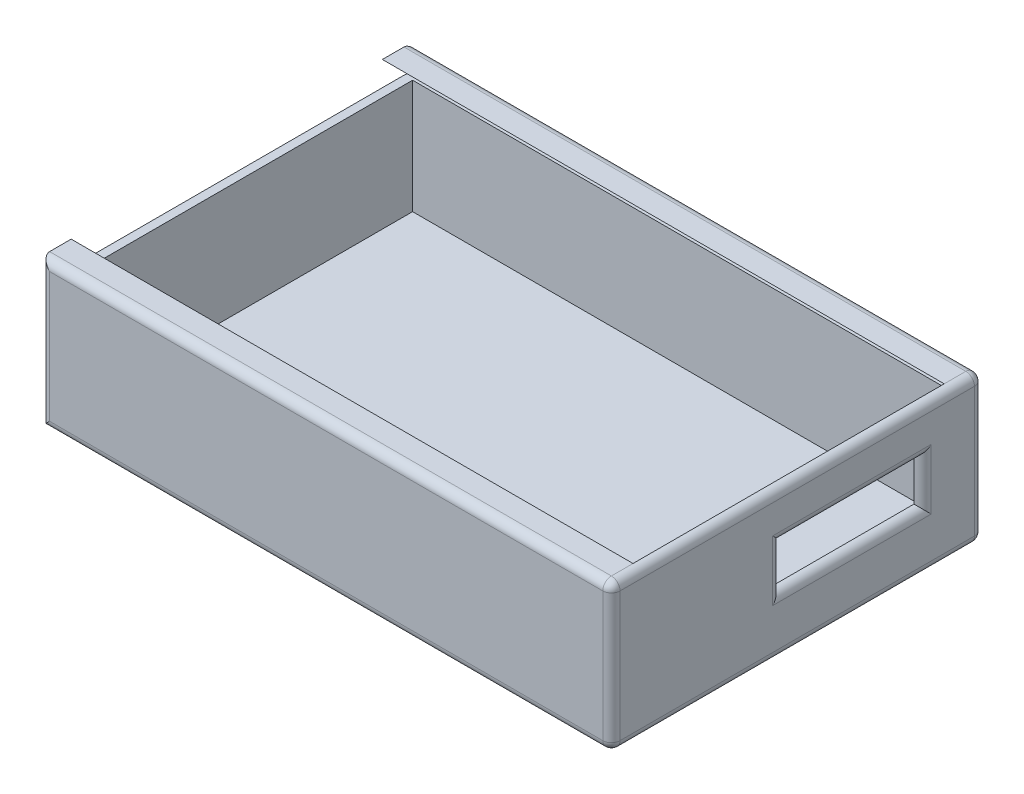
ISO-10303-21;
HEADER;
FILE_DESCRIPTION(('STEP AP214'),'2;1');
FILE_NAME('part.step','',(''),(''),'','','');
FILE_SCHEMA(('AUTOMOTIVE_DESIGN { 1 0 10303 214 1 1 1 1 }'));
ENDSEC;
DATA;
#1=APPLICATION_CONTEXT('core data for automotive mechanical design processes');
#2=APPLICATION_PROTOCOL_DEFINITION('international standard','automotive_design',2000,#1);
#3=PRODUCT_CONTEXT('',#1,'mechanical');
#4=PRODUCT('Part','Part','',(#3));
#5=PRODUCT_RELATED_PRODUCT_CATEGORY('part','',(#4));
#6=PRODUCT_DEFINITION_FORMATION('','',#4);
#7=PRODUCT_DEFINITION_CONTEXT('part definition',#1,'design');
#8=PRODUCT_DEFINITION('design','',#6,#7);
#9=PRODUCT_DEFINITION_SHAPE('','',#8);
#10=(LENGTH_UNIT() NAMED_UNIT(*) SI_UNIT(.MILLI.,.METRE.));
#11=(NAMED_UNIT(*) PLANE_ANGLE_UNIT() SI_UNIT($,.RADIAN.));
#12=(NAMED_UNIT(*) SI_UNIT($,.STERADIAN.) SOLID_ANGLE_UNIT());
#13=UNCERTAINTY_MEASURE_WITH_UNIT(LENGTH_MEASURE(1.E-05),#10,'distance_accuracy_value','');
#14=(GEOMETRIC_REPRESENTATION_CONTEXT(3) GLOBAL_UNCERTAINTY_ASSIGNED_CONTEXT((#13)) GLOBAL_UNIT_ASSIGNED_CONTEXT((#10,
#11,#12)) REPRESENTATION_CONTEXT('',''));
#15=CARTESIAN_POINT('',(0.,0.,0.));
#16=DIRECTION('',(0.,0.,1.));
#17=DIRECTION('',(1.,0.,0.));
#18=AXIS2_PLACEMENT_3D('',#15,#16,#17);
#19=CARTESIAN_POINT('',(-65.4502937062937,43.18,-49.3799090909091));
#20=DIRECTION('',(1.,0.,0.));
#21=DIRECTION('',(0.,0.,-1.));
#22=AXIS2_PLACEMENT_3D('',#19,#20,#21);
#23=PLANE('',#22);
#24=DIRECTION('',(0.,0.,1.));
#25=VECTOR('',#24,1.);
#26=CARTESIAN_POINT('',(-65.4502937062937,43.18,-49.3799090909091));
#27=LINE('',#26,#25);
#28=CARTESIAN_POINT('',(-65.4502937062937,43.18,-46.8399090909091));
#29=VERTEX_POINT('',#28);
#30=CARTESIAN_POINT('',(-65.4502937062937,43.18,-40.4899090909091));
#31=VERTEX_POINT('',#30);
#32=EDGE_CURVE('E399',#29,#31,#27,.T.);
#33=ORIENTED_EDGE('',*,*,#32,.F.);
#34=DIRECTION('',(0.,-1.,0.));
#35=VECTOR('',#34,1.);
#36=CARTESIAN_POINT('',(-65.4502937062937,43.18,-46.8399090909091));
#37=LINE('',#36,#35);
#38=CARTESIAN_POINT('',(-65.4502937062937,36.8300000000001,-46.8399090909091));
#39=VERTEX_POINT('',#38);
#40=EDGE_CURVE('E357',#29,#39,#37,.T.);
#41=ORIENTED_EDGE('',*,*,#40,.T.);
#42=DIRECTION('',(0.,-0.707106781186544,-0.707106781186551));
#43=VECTOR('',#42,1.);
#44=CARTESIAN_POINT('',(-65.4502937062937,43.18,-40.4899090909091));
#45=LINE('',#44,#43);
#46=EDGE_CURVE('E250',#31,#39,#45,.T.);
#47=ORIENTED_EDGE('',*,*,#46,.F.);
#48=EDGE_LOOP('',(#33,#41,#47));
#49=FACE_BOUND('',#48,.T.);
#50=ADVANCED_FACE('F49',(#49),#23,.F.);
#51=DIRECTION('',(0.,0.,1.));
#52=VECTOR('',#51,1.);
#53=CARTESIAN_POINT('',(-65.4502937062937,35.9957951031447,-47.6741139877644));
#54=LINE('',#53,#52);
#55=CARTESIAN_POINT('',(-65.4502937062937,35.9957951031447,-46.8399090909091));
#56=VERTEX_POINT('',#55);
#57=CARTESIAN_POINT('',(-65.4502937062937,35.9957951031447,57.3000909090909));
#58=VERTEX_POINT('',#57);
#59=EDGE_CURVE('E474',#56,#58,#54,.T.);
#60=ORIENTED_EDGE('',*,*,#59,.F.);
#61=DIRECTION('',(0.,-1.,0.));
#62=VECTOR('',#61,1.);
#63=CARTESIAN_POINT('',(-65.4502937062937,43.18,-46.8399090909091));
#64=LINE('',#63,#62);
#65=CARTESIAN_POINT('',(-65.4502937062937,0.,-46.8399090909091));
#66=VERTEX_POINT('',#65);
#67=EDGE_CURVE('E360',#56,#66,#64,.T.);
#68=ORIENTED_EDGE('',*,*,#67,.T.);
#69=DIRECTION('',(0.,0.,1.));
#70=VECTOR('',#69,1.);
#71=CARTESIAN_POINT('',(-65.4502937062937,0.,-49.3799090909091));
#72=LINE('',#71,#70);
#73=CARTESIAN_POINT('',(-65.4502937062937,0.,57.3000909090909));
#74=VERTEX_POINT('',#73);
#75=EDGE_CURVE('E400',#66,#74,#72,.T.);
#76=ORIENTED_EDGE('',*,*,#75,.T.);
#77=DIRECTION('',(0.,-1.,0.));
#78=VECTOR('',#77,1.);
#79=CARTESIAN_POINT('',(-65.4502937062937,43.18,57.3000909090909));
#80=LINE('',#79,#78);
#81=EDGE_CURVE('E363',#74,#58,#80,.F.);
#82=ORIENTED_EDGE('',*,*,#81,.T.);
#83=EDGE_LOOP('',(#60,#68,#76,#82));
#84=FACE_BOUND('',#83,.T.);
#85=ADVANCED_FACE('F580',(#84),#23,.F.);
#86=CARTESIAN_POINT('',(0.,43.18,0.));
#87=DIRECTION('',(0.,1.,0.));
#88=DIRECTION('',(0.,0.,1.));
#89=AXIS2_PLACEMENT_3D('',#86,#87,#88);
#90=PLANE('',#89);
#91=DIRECTION('',(0.,0.,-1.));
#92=VECTOR('',#91,1.);
#93=CARTESIAN_POINT('',(99.6497062937063,43.18,-49.3799090909091));
#94=LINE('',#93,#92);
#95=CARTESIAN_POINT('',(99.6497062937063,43.18,-40.4899090909091));
#96=VERTEX_POINT('',#95);
#97=CARTESIAN_POINT('',(99.6497062937063,43.18,-46.8399090909091));
#98=VERTEX_POINT('',#97);
#99=EDGE_CURVE('E386',#96,#98,#94,.T.);
#100=ORIENTED_EDGE('',*,*,#99,.T.);
#101=DIRECTION('',(-1.,0.,0.));
#102=VECTOR('',#101,1.);
#103=CARTESIAN_POINT('',(-65.4502937062937,43.18,-46.8399090909091));
#104=LINE('',#103,#102);
#105=EDGE_CURVE('E382',#98,#29,#104,.T.);
#106=ORIENTED_EDGE('',*,*,#105,.T.);
#107=ORIENTED_EDGE('',*,*,#32,.T.);
#108=DIRECTION('',(-1.,0.,0.));
#109=VECTOR('',#108,1.);
#110=CARTESIAN_POINT('',(205.701733068652,43.18,-40.4899090909091));
#111=LINE('',#110,#109);
#112=EDGE_CURVE('E466',#96,#31,#111,.T.);
#113=ORIENTED_EDGE('',*,*,#112,.F.);
#114=EDGE_LOOP('',(#100,#106,#107,#113));
#115=FACE_BOUND('',#114,.T.);
#116=ADVANCED_FACE('F502',(#115),#90,.T.);
#117=CARTESIAN_POINT('',(99.6497062937063,43.18,-49.3799090909091));
#118=DIRECTION('',(-1.,0.,0.));
#119=DIRECTION('',(0.,0.,1.));
#120=AXIS2_PLACEMENT_3D('',#117,#118,#119);
#121=PLANE('',#120);
#122=DIRECTION('',(0.,0.,-1.));
#123=VECTOR('',#122,1.);
#124=CARTESIAN_POINT('',(99.6497062937063,29.6823840244611,-31.5999090909091));
#125=LINE('',#124,#123);
#126=CARTESIAN_POINT('',(99.6497062937063,29.6823840244611,9.93829321179274));
#127=VERTEX_POINT('',#126);
#128=CARTESIAN_POINT('',(99.6497062937063,29.6823840244611,-31.5999090909091));
#129=VERTEX_POINT('',#128);
#130=EDGE_CURVE('E218',#127,#129,#125,.T.);
#131=ORIENTED_EDGE('',*,*,#130,.F.);
#132=DIRECTION('',(0.,1.,0.));
#133=VECTOR('',#132,1.);
#134=CARTESIAN_POINT('',(99.6497062937063,32.2223840244611,9.93829321179274));
#135=LINE('',#134,#133);
#136=CARTESIAN_POINT('',(99.6497062937063,17.018,9.93829321179274));
#137=VERTEX_POINT('',#136);
#138=EDGE_CURVE('E211',#137,#127,#135,.T.);
#139=ORIENTED_EDGE('',*,*,#138,.F.);
#140=DIRECTION('',(0.,0.,1.));
#141=VECTOR('',#140,1.);
#142=CARTESIAN_POINT('',(99.6497062937063,17.018,-31.5999090909091));
#143=LINE('',#142,#141);
#144=CARTESIAN_POINT('',(99.6497062937063,17.018,-31.5999090909091));
#145=VERTEX_POINT('',#144);
#146=EDGE_CURVE('E216',#145,#137,#143,.T.);
#147=ORIENTED_EDGE('',*,*,#146,.F.);
#148=DIRECTION('',(0.,-1.,0.));
#149=VECTOR('',#148,1.);
#150=CARTESIAN_POINT('',(99.6497062937063,29.6823840244611,-31.5999090909091));
#151=LINE('',#150,#149);
#152=EDGE_CURVE('E231',#129,#145,#151,.T.);
#153=ORIENTED_EDGE('',*,*,#152,.F.);
#154=EDGE_LOOP('',(#131,#139,#147,#153));
#155=FACE_BOUND('',#154,.T.);
#156=DIRECTION('',(0.,0.,-1.));
#157=VECTOR('',#156,1.);
#158=CARTESIAN_POINT('',(99.6497062937063,43.18,-49.3799090909091));
#159=LINE('',#158,#157);
#160=CARTESIAN_POINT('',(99.6497062937063,43.18,50.9500909090909));
#161=VERTEX_POINT('',#160);
#162=EDGE_CURVE('E408',#161,#96,#159,.T.);
#163=ORIENTED_EDGE('',*,*,#162,.T.);
#164=DIRECTION('',(0.,0.707106781186544,0.707106781186551));
#165=VECTOR('',#164,1.);
#166=CARTESIAN_POINT('',(99.6497062937063,43.18,-40.4899090909091));
#167=LINE('',#166,#165);
#168=CARTESIAN_POINT('',(99.6497062937063,35.9957951031447,-47.6741139877644));
#169=VERTEX_POINT('',#168);
#170=EDGE_CURVE('E481',#169,#96,#167,.T.);
#171=ORIENTED_EDGE('',*,*,#170,.F.);
#172=DIRECTION('',(0.,0.,-1.));
#173=VECTOR('',#172,1.);
#174=CARTESIAN_POINT('',(99.6497062937063,35.9957951031447,-47.6741139877644));
#175=LINE('',#174,#173);
#176=CARTESIAN_POINT('',(99.6497062937063,35.9957951031447,-46.8399090909091));
#177=VERTEX_POINT('',#176);
#178=EDGE_CURVE('E452',#177,#169,#175,.T.);
#179=ORIENTED_EDGE('',*,*,#178,.F.);
#180=DIRECTION('',(0.,-1.,0.));
#181=VECTOR('',#180,1.);
#182=CARTESIAN_POINT('',(99.6497062937063,43.18,-46.8399090909091));
#183=LINE('',#182,#181);
#184=CARTESIAN_POINT('',(99.6497062937063,2.54,-46.8399090909091));
#185=VERTEX_POINT('',#184);
#186=EDGE_CURVE('E418',#177,#185,#183,.T.);
#187=ORIENTED_EDGE('',*,*,#186,.T.);
#188=DIRECTION('',(0.,0.,-1.));
#189=VECTOR('',#188,1.);
#190=CARTESIAN_POINT('',(99.6497062937063,2.54,-49.3799090909091));
#191=LINE('',#190,#189);
#192=CARTESIAN_POINT('',(99.6497062937063,2.54,57.3000909090909));
#193=VERTEX_POINT('',#192);
#194=EDGE_CURVE('E417',#193,#185,#191,.T.);
#195=ORIENTED_EDGE('',*,*,#194,.F.);
#196=DIRECTION('',(0.,-1.,0.));
#197=VECTOR('',#196,1.);
#198=CARTESIAN_POINT('',(99.6497062937063,43.18,57.3000909090909));
#199=LINE('',#198,#197);
#200=CARTESIAN_POINT('',(99.6497062937063,35.9957951031447,57.3000909090909));
#201=VERTEX_POINT('',#200);
#202=EDGE_CURVE('E421',#201,#193,#199,.T.);
#203=ORIENTED_EDGE('',*,*,#202,.F.);
#204=CARTESIAN_POINT('',(99.6497062937063,35.9957951031447,58.1342958059463));
#205=VERTEX_POINT('',#204);
#206=EDGE_CURVE('E449',#205,#201,#175,.T.);
#207=ORIENTED_EDGE('',*,*,#206,.F.);
#208=DIRECTION('',(0.,0.707106781186544,-0.707106781186551));
#209=VECTOR('',#208,1.);
#210=CARTESIAN_POINT('',(99.6497062937063,43.18,50.9500909090909));
#211=LINE('',#210,#209);
#212=EDGE_CURVE('E470',#205,#161,#211,.T.);
#213=ORIENTED_EDGE('',*,*,#212,.T.);
#214=EDGE_LOOP('',(#163,#171,#179,#187,#195,#203,#207,#213));
#215=FACE_BOUND('',#214,.T.);
#216=ADVANCED_FACE('F213',(#155,#215),#121,.T.);
#217=DIRECTION('',(0.,-0.707106781186544,0.707106781186551));
#218=VECTOR('',#217,1.);
#219=CARTESIAN_POINT('',(-65.4502937062937,43.18,50.9500909090909));
#220=LINE('',#219,#218);
#221=CARTESIAN_POINT('',(-65.4502937062937,43.18,50.9500909090909));
#222=VERTEX_POINT('',#221);
#223=CARTESIAN_POINT('',(-65.4502937062937,36.8300000000001,57.3000909090909));
#224=VERTEX_POINT('',#223);
#225=EDGE_CURVE('E458',#222,#224,#220,.T.);
#226=ORIENTED_EDGE('',*,*,#225,.T.);
#227=DIRECTION('',(0.,-1.,0.));
#228=VECTOR('',#227,1.);
#229=CARTESIAN_POINT('',(-65.4502937062937,43.18,57.3000909090909));
#230=LINE('',#229,#228);
#231=CARTESIAN_POINT('',(-65.4502937062937,43.18,57.3000909090909));
#232=VERTEX_POINT('',#231);
#233=EDGE_CURVE('E366',#224,#232,#230,.F.);
#234=ORIENTED_EDGE('',*,*,#233,.T.);
#235=EDGE_CURVE('E404',#222,#232,#27,.T.);
#236=ORIENTED_EDGE('',*,*,#235,.F.);
#237=EDGE_LOOP('',(#226,#234,#236));
#238=FACE_BOUND('',#237,.T.);
#239=ADVANCED_FACE('F543',(#238),#23,.F.);
#240=CARTESIAN_POINT('',(-65.4502937062937,43.18,59.8400909090909));
#241=DIRECTION('',(0.,0.,-1.));
#242=DIRECTION('',(-1.,0.,0.));
#243=AXIS2_PLACEMENT_3D('',#240,#241,#242);
#244=PLANE('',#243);
#245=DIRECTION('',(1.,0.,0.));
#246=VECTOR('',#245,1.);
#247=CARTESIAN_POINT('',(-65.4502937062937,40.64,59.8400909090909));
#248=LINE('',#247,#246);
#249=CARTESIAN_POINT('',(99.6497062937063,40.64,59.8400909090909));
#250=VERTEX_POINT('',#249);
#251=CARTESIAN_POINT('',(-62.9102937062937,40.64,59.8400909090909));
#252=VERTEX_POINT('',#251);
#253=EDGE_CURVE('E310',#250,#252,#248,.F.);
#254=ORIENTED_EDGE('',*,*,#253,.T.);
#255=DIRECTION('',(0.,-1.,0.));
#256=VECTOR('',#255,1.);
#257=CARTESIAN_POINT('',(-62.9102937062937,43.18,59.8400909090909));
#258=LINE('',#257,#256);
#259=CARTESIAN_POINT('',(-62.9102937062937,2.54,59.8400909090909));
#260=VERTEX_POINT('',#259);
#261=EDGE_CURVE('E239',#252,#260,#258,.T.);
#262=ORIENTED_EDGE('',*,*,#261,.T.);
#263=DIRECTION('',(1.,0.,0.));
#264=VECTOR('',#263,1.);
#265=CARTESIAN_POINT('',(-65.4502937062937,2.54,59.8400909090909));
#266=LINE('',#265,#264);
#267=CARTESIAN_POINT('',(99.6497062937063,2.54,59.8400909090909));
#268=VERTEX_POINT('',#267);
#269=EDGE_CURVE('E316',#260,#268,#266,.T.);
#270=ORIENTED_EDGE('',*,*,#269,.T.);
#271=DIRECTION('',(0.,-1.,0.));
#272=VECTOR('',#271,1.);
#273=CARTESIAN_POINT('',(99.6497062937063,43.18,59.8400909090909));
#274=LINE('',#273,#272);
#275=EDGE_CURVE('E313',#268,#250,#274,.F.);
#276=ORIENTED_EDGE('',*,*,#275,.T.);
#277=EDGE_LOOP('',(#254,#262,#270,#276));
#278=FACE_BOUND('',#277,.T.);
#279=ADVANCED_FACE('F610',(#278),#244,.F.);
#280=CARTESIAN_POINT('',(102.189706293706,43.18,-49.3799090909091));
#281=DIRECTION('',(-1.,0.,0.));
#282=DIRECTION('',(0.,0.,1.));
#283=AXIS2_PLACEMENT_3D('',#280,#281,#282);
#284=PLANE('',#283);
#285=DIRECTION('',(0.,1.,0.));
#286=VECTOR('',#285,1.);
#287=CARTESIAN_POINT('',(102.189706293706,32.2223840244611,12.4782932117927));
#288=LINE('',#287,#286);
#289=CARTESIAN_POINT('',(102.189706293706,14.478,12.4782932117927));
#290=VERTEX_POINT('',#289);
#291=CARTESIAN_POINT('',(102.189706293706,32.2223840244611,12.4782932117927));
#292=VERTEX_POINT('',#291);
#293=EDGE_CURVE('E233',#290,#292,#288,.T.);
#294=ORIENTED_EDGE('',*,*,#293,.T.);
#295=DIRECTION('',(0.,0.,-1.));
#296=VECTOR('',#295,1.);
#297=CARTESIAN_POINT('',(102.189706293706,32.2223840244611,-49.3799090909091));
#298=LINE('',#297,#296);
#299=CARTESIAN_POINT('',(102.189706293706,32.2223840244611,-34.1399090909091));
#300=VERTEX_POINT('',#299);
#301=EDGE_CURVE('E65',#292,#300,#298,.T.);
#302=ORIENTED_EDGE('',*,*,#301,.T.);
#303=DIRECTION('',(0.,-1.,0.));
#304=VECTOR('',#303,1.);
#305=CARTESIAN_POINT('',(102.189706293706,43.18,-34.1399090909091));
#306=LINE('',#305,#304);
#307=CARTESIAN_POINT('',(102.189706293706,14.478,-34.1399090909091));
#308=VERTEX_POINT('',#307);
#309=EDGE_CURVE('E321',#300,#308,#306,.T.);
#310=ORIENTED_EDGE('',*,*,#309,.T.);
#311=DIRECTION('',(0.,0.,1.));
#312=VECTOR('',#311,1.);
#313=CARTESIAN_POINT('',(102.189706293706,14.478,-49.3799090909091));
#314=LINE('',#313,#312);
#315=EDGE_CURVE('E73',#308,#290,#314,.T.);
#316=ORIENTED_EDGE('',*,*,#315,.T.);
#317=EDGE_LOOP('',(#294,#302,#310,#316));
#318=FACE_BOUND('',#317,.T.);
#319=DIRECTION('',(0.,-1.,0.));
#320=VECTOR('',#319,1.);
#321=CARTESIAN_POINT('',(102.189706293706,43.18,-46.8399090909091));
#322=LINE('',#321,#320);
#323=CARTESIAN_POINT('',(102.189706293706,2.54,-46.8399090909091));
#324=VERTEX_POINT('',#323);
#325=CARTESIAN_POINT('',(102.189706293706,40.64,-46.8399090909091));
#326=VERTEX_POINT('',#325);
#327=EDGE_CURVE('E330',#324,#326,#322,.F.);
#328=ORIENTED_EDGE('',*,*,#327,.T.);
#329=DIRECTION('',(0.,0.,-1.));
#330=VECTOR('',#329,1.);
#331=CARTESIAN_POINT('',(102.189706293706,40.64,59.8400909090909));
#332=LINE('',#331,#330);
#333=CARTESIAN_POINT('',(102.189706293706,40.64,57.3000909090909));
#334=VERTEX_POINT('',#333);
#335=EDGE_CURVE('E326',#326,#334,#332,.F.);
#336=ORIENTED_EDGE('',*,*,#335,.T.);
#337=DIRECTION('',(0.,-1.,0.));
#338=VECTOR('',#337,1.);
#339=CARTESIAN_POINT('',(102.189706293706,43.18,57.3000909090909));
#340=LINE('',#339,#338);
#341=CARTESIAN_POINT('',(102.189706293706,2.54,57.3000909090909));
#342=VERTEX_POINT('',#341);
#343=EDGE_CURVE('E336',#334,#342,#340,.T.);
#344=ORIENTED_EDGE('',*,*,#343,.T.);
#345=DIRECTION('',(0.,0.,-1.));
#346=VECTOR('',#345,1.);
#347=CARTESIAN_POINT('',(102.189706293706,2.54,-49.3799090909091));
#348=LINE('',#347,#346);
#349=EDGE_CURVE('E333',#342,#324,#348,.T.);
#350=ORIENTED_EDGE('',*,*,#349,.T.);
#351=EDGE_LOOP('',(#328,#336,#344,#350));
#352=FACE_BOUND('',#351,.T.);
#353=ADVANCED_FACE('F612',(#318,#352),#284,.F.);
#354=CARTESIAN_POINT('',(-65.4502937062937,43.18,-49.3799090909091));
#355=DIRECTION('',(0.,0.,1.));
#356=DIRECTION('',(1.,0.,0.));
#357=AXIS2_PLACEMENT_3D('',#354,#355,#356);
#358=PLANE('',#357);
#359=DIRECTION('',(0.,-1.,0.));
#360=VECTOR('',#359,1.);
#361=CARTESIAN_POINT('',(-62.9102937062937,43.18,-49.3799090909091));
#362=LINE('',#361,#360);
#363=CARTESIAN_POINT('',(-62.9102937062937,2.54,-49.3799090909091));
#364=VERTEX_POINT('',#363);
#365=CARTESIAN_POINT('',(-62.9102937062937,40.64,-49.3799090909091));
#366=VERTEX_POINT('',#365);
#367=EDGE_CURVE('E373',#364,#366,#362,.F.);
#368=ORIENTED_EDGE('',*,*,#367,.T.);
#369=DIRECTION('',(-1.,0.,0.));
#370=VECTOR('',#369,1.);
#371=CARTESIAN_POINT('',(102.189706293706,40.64,-49.3799090909091));
#372=LINE('',#371,#370);
#373=CARTESIAN_POINT('',(99.6497062937063,40.64,-49.3799090909091));
#374=VERTEX_POINT('',#373);
#375=EDGE_CURVE('E369',#366,#374,#372,.F.);
#376=ORIENTED_EDGE('',*,*,#375,.T.);
#377=DIRECTION('',(0.,-1.,0.));
#378=VECTOR('',#377,1.);
#379=CARTESIAN_POINT('',(99.6497062937063,43.18,-49.3799090909091));
#380=LINE('',#379,#378);
#381=CARTESIAN_POINT('',(99.6497062937063,2.54,-49.3799090909091));
#382=VERTEX_POINT('',#381);
#383=EDGE_CURVE('E379',#374,#382,#380,.T.);
#384=ORIENTED_EDGE('',*,*,#383,.T.);
#385=DIRECTION('',(-1.,0.,0.));
#386=VECTOR('',#385,1.);
#387=CARTESIAN_POINT('',(-65.4502937062937,2.54,-49.3799090909091));
#388=LINE('',#387,#386);
#389=EDGE_CURVE('E376',#382,#364,#388,.T.);
#390=ORIENTED_EDGE('',*,*,#389,.T.);
#391=EDGE_LOOP('',(#368,#376,#384,#390));
#392=FACE_BOUND('',#391,.T.);
#393=ADVANCED_FACE('F619',(#392),#358,.F.);
#394=DIRECTION('',(1.,0.,0.));
#395=VECTOR('',#394,1.);
#396=CARTESIAN_POINT('',(102.189706293706,43.18,57.3000909090909));
#397=LINE('',#396,#395);
#398=CARTESIAN_POINT('',(99.6497062937063,43.18,57.3000909090909));
#399=VERTEX_POINT('',#398);
#400=EDGE_CURVE('E392',#232,#399,#397,.T.);
#401=ORIENTED_EDGE('',*,*,#400,.T.);
#402=DIRECTION('',(0.,0.,-1.));
#403=VECTOR('',#402,1.);
#404=CARTESIAN_POINT('',(99.6497062937063,43.18,-49.3799090909091));
#405=LINE('',#404,#403);
#406=EDGE_CURVE('E389',#399,#161,#405,.T.);
#407=ORIENTED_EDGE('',*,*,#406,.T.);
#408=DIRECTION('',(-1.,0.,0.));
#409=VECTOR('',#408,1.);
#410=CARTESIAN_POINT('',(205.701733068652,43.18,50.9500909090909));
#411=LINE('',#410,#409);
#412=EDGE_CURVE('E462',#161,#222,#411,.T.);
#413=ORIENTED_EDGE('',*,*,#412,.T.);
#414=ORIENTED_EDGE('',*,*,#235,.T.);
#415=EDGE_LOOP('',(#401,#407,#413,#414));
#416=FACE_BOUND('',#415,.T.);
#417=ADVANCED_FACE('F545',(#416),#90,.T.);
#418=CARTESIAN_POINT('',(0.,0.,0.));
#419=DIRECTION('',(0.,1.,0.));
#420=DIRECTION('',(0.,0.,1.));
#421=AXIS2_PLACEMENT_3D('',#418,#419,#420);
#422=PLANE('',#421);
#423=ORIENTED_EDGE('',*,*,#75,.F.);
#424=DIRECTION('',(-1.,0.,0.));
#425=VECTOR('',#424,1.);
#426=CARTESIAN_POINT('',(0.,0.,-46.8399090909091));
#427=LINE('',#426,#425);
#428=CARTESIAN_POINT('',(99.6497062937063,0.,-46.8399090909091));
#429=VERTEX_POINT('',#428);
#430=EDGE_CURVE('E339',#66,#429,#427,.F.);
#431=ORIENTED_EDGE('',*,*,#430,.T.);
#432=DIRECTION('',(0.,0.,-1.));
#433=VECTOR('',#432,1.);
#434=CARTESIAN_POINT('',(99.6497062937063,0.,0.));
#435=LINE('',#434,#433);
#436=CARTESIAN_POINT('',(99.6497062937063,0.,57.3000909090909));
#437=VERTEX_POINT('',#436);
#438=EDGE_CURVE('E342',#429,#437,#435,.F.);
#439=ORIENTED_EDGE('',*,*,#438,.T.);
#440=DIRECTION('',(1.,0.,0.));
#441=VECTOR('',#440,1.);
#442=CARTESIAN_POINT('',(0.,0.,57.3000909090909));
#443=LINE('',#442,#441);
#444=EDGE_CURVE('E345',#437,#74,#443,.F.);
#445=ORIENTED_EDGE('',*,*,#444,.T.);
#446=EDGE_LOOP('',(#423,#431,#439,#445));
#447=FACE_BOUND('',#446,.T.);
#448=ADVANCED_FACE('F584',(#447),#422,.F.);
#449=CARTESIAN_POINT('',(-62.9102937062937,43.18,-49.3799090909091));
#450=DIRECTION('',(1.,0.,0.));
#451=DIRECTION('',(0.,0.,-1.));
#452=AXIS2_PLACEMENT_3D('',#449,#450,#451);
#453=PLANE('',#452);
#454=DIRECTION('',(0.,0.,-1.));
#455=VECTOR('',#454,1.);
#456=CARTESIAN_POINT('',(-62.9102937062937,35.9957951031447,-49.3799090909091));
#457=LINE('',#456,#455);
#458=CARTESIAN_POINT('',(-62.9102937062937,35.9957951031447,57.3000909090909));
#459=VERTEX_POINT('',#458);
#460=CARTESIAN_POINT('',(-62.9102937062937,35.9957951031447,-46.8399090909091));
#461=VERTEX_POINT('',#460);
#462=EDGE_CURVE('E446',#459,#461,#457,.T.);
#463=ORIENTED_EDGE('',*,*,#462,.F.);
#464=DIRECTION('',(0.,-1.,0.));
#465=VECTOR('',#464,1.);
#466=CARTESIAN_POINT('',(-62.9102937062937,43.18,57.3000909090909));
#467=LINE('',#466,#465);
#468=CARTESIAN_POINT('',(-62.9102937062937,2.54,57.3000909090909));
#469=VERTEX_POINT('',#468);
#470=EDGE_CURVE('E405',#459,#469,#467,.T.);
#471=ORIENTED_EDGE('',*,*,#470,.T.);
#472=DIRECTION('',(0.,0.,1.));
#473=VECTOR('',#472,1.);
#474=CARTESIAN_POINT('',(-62.9102937062937,2.54,-49.3799090909091));
#475=LINE('',#474,#473);
#476=CARTESIAN_POINT('',(-62.9102937062937,2.54,-46.8399090909091));
#477=VERTEX_POINT('',#476);
#478=EDGE_CURVE('E431',#477,#469,#475,.T.);
#479=ORIENTED_EDGE('',*,*,#478,.F.);
#480=DIRECTION('',(0.,-1.,0.));
#481=VECTOR('',#480,1.);
#482=CARTESIAN_POINT('',(-62.9102937062937,43.18,-46.8399090909091));
#483=LINE('',#482,#481);
#484=EDGE_CURVE('E412',#461,#477,#483,.T.);
#485=ORIENTED_EDGE('',*,*,#484,.F.);
#486=EDGE_LOOP('',(#463,#471,#479,#485));
#487=FACE_BOUND('',#486,.T.);
#488=ADVANCED_FACE('F524',(#487),#453,.T.);
#489=CARTESIAN_POINT('',(-65.4502937062937,43.18,57.3000909090909));
#490=DIRECTION('',(0.,0.,-1.));
#491=DIRECTION('',(-1.,0.,0.));
#492=AXIS2_PLACEMENT_3D('',#489,#490,#491);
#493=PLANE('',#492);
#494=DIRECTION('',(-1.,0.,0.));
#495=VECTOR('',#494,1.);
#496=CARTESIAN_POINT('',(-65.4502937062937,35.9957951031447,57.3000909090909));
#497=LINE('',#496,#495);
#498=EDGE_CURVE('E443',#201,#459,#497,.T.);
#499=ORIENTED_EDGE('',*,*,#498,.F.);
#500=ORIENTED_EDGE('',*,*,#202,.T.);
#501=DIRECTION('',(1.,0.,0.));
#502=VECTOR('',#501,1.);
#503=CARTESIAN_POINT('',(-65.4502937062937,2.54,57.3000909090909));
#504=LINE('',#503,#502);
#505=EDGE_CURVE('E425',#469,#193,#504,.T.);
#506=ORIENTED_EDGE('',*,*,#505,.F.);
#507=ORIENTED_EDGE('',*,*,#470,.F.);
#508=EDGE_LOOP('',(#499,#500,#506,#507));
#509=FACE_BOUND('',#508,.T.);
#510=ADVANCED_FACE('F529',(#509),#493,.T.);
#511=CARTESIAN_POINT('',(-65.4502937062937,43.18,-46.8399090909091));
#512=DIRECTION('',(0.,0.,1.));
#513=DIRECTION('',(1.,0.,0.));
#514=AXIS2_PLACEMENT_3D('',#511,#512,#513);
#515=PLANE('',#514);
#516=DIRECTION('',(1.,0.,0.));
#517=VECTOR('',#516,1.);
#518=CARTESIAN_POINT('',(-65.4502937062937,35.9957951031447,-46.8399090909091));
#519=LINE('',#518,#517);
#520=EDGE_CURVE('E395',#461,#177,#519,.T.);
#521=ORIENTED_EDGE('',*,*,#520,.F.);
#522=ORIENTED_EDGE('',*,*,#484,.T.);
#523=DIRECTION('',(-1.,0.,0.));
#524=VECTOR('',#523,1.);
#525=CARTESIAN_POINT('',(-65.4502937062937,2.54,-46.8399090909091));
#526=LINE('',#525,#524);
#527=EDGE_CURVE('E413',#185,#477,#526,.T.);
#528=ORIENTED_EDGE('',*,*,#527,.F.);
#529=ORIENTED_EDGE('',*,*,#186,.F.);
#530=EDGE_LOOP('',(#521,#522,#528,#529));
#531=FACE_BOUND('',#530,.T.);
#532=ADVANCED_FACE('F519',(#531),#515,.T.);
#533=CARTESIAN_POINT('',(0.,2.54,0.));
#534=DIRECTION('',(0.,1.,0.));
#535=DIRECTION('',(0.,0.,1.));
#536=AXIS2_PLACEMENT_3D('',#533,#534,#535);
#537=PLANE('',#536);
#538=ORIENTED_EDGE('',*,*,#478,.T.);
#539=ORIENTED_EDGE('',*,*,#505,.T.);
#540=ORIENTED_EDGE('',*,*,#194,.T.);
#541=ORIENTED_EDGE('',*,*,#527,.T.);
#542=EDGE_LOOP('',(#538,#539,#540,#541));
#543=FACE_BOUND('',#542,.T.);
#544=ADVANCED_FACE('F522',(#543),#537,.T.);
#545=CARTESIAN_POINT('',(205.701733068652,43.18,-40.4899090909091));
#546=DIRECTION('',(0.,0.707106781186551,-0.707106781186544));
#547=DIRECTION('',(0.,0.707106781186544,0.707106781186551));
#548=AXIS2_PLACEMENT_3D('',#545,#546,#547);
#549=PLANE('',#548);
#550=ORIENTED_EDGE('',*,*,#46,.T.);
#551=CARTESIAN_POINT('',(-62.9102937062937,36.8300000000001,-46.8399090909091));
#552=DIRECTION('',(0.,0.707106781186551,-0.707106781186544));
#553=DIRECTION('',(0.,-0.707106781186544,-0.707106781186551));
#554=AXIS2_PLACEMENT_3D('',#551,#552,#553);
#555=ELLIPSE('',#554,3.59210244842764,2.54);
#556=CARTESIAN_POINT('',(-65.3093981621402,35.9957951031447,-47.6741139877644));
#557=VERTEX_POINT('',#556);
#558=EDGE_CURVE('E354',#39,#557,#555,.F.);
#559=ORIENTED_EDGE('',*,*,#558,.T.);
#560=DIRECTION('',(-1.,0.,0.));
#561=VECTOR('',#560,1.);
#562=CARTESIAN_POINT('',(205.701733068652,35.9957951031447,-47.6741139877644));
#563=LINE('',#562,#561);
#564=EDGE_CURVE('E453',#169,#557,#563,.T.);
#565=ORIENTED_EDGE('',*,*,#564,.F.);
#566=ORIENTED_EDGE('',*,*,#170,.T.);
#567=ORIENTED_EDGE('',*,*,#112,.T.);
#568=EDGE_LOOP('',(#550,#559,#565,#566,#567));
#569=FACE_BOUND('',#568,.T.);
#570=ADVANCED_FACE('F508',(#569),#549,.F.);
#571=CARTESIAN_POINT('',(205.701733068652,43.18,50.9500909090909));
#572=DIRECTION('',(0.,-0.707106781186551,-0.707106781186544));
#573=DIRECTION('',(0.,0.707106781186544,-0.707106781186551));
#574=AXIS2_PLACEMENT_3D('',#571,#572,#573);
#575=PLANE('',#574);
#576=DIRECTION('',(-1.,0.,0.));
#577=VECTOR('',#576,1.);
#578=CARTESIAN_POINT('',(205.701733068652,35.9957951031447,58.1342958059463));
#579=LINE('',#578,#577);
#580=CARTESIAN_POINT('',(-65.3093981621402,35.9957951031447,58.1342958059463));
#581=VERTEX_POINT('',#580);
#582=EDGE_CURVE('E457',#205,#581,#579,.T.);
#583=ORIENTED_EDGE('',*,*,#582,.T.);
#584=CARTESIAN_POINT('',(-62.9102937062937,36.8300000000001,57.3000909090909));
#585=DIRECTION('',(0.,-0.707106781186551,-0.707106781186544));
#586=DIRECTION('',(0.,-0.707106781186544,0.707106781186551));
#587=AXIS2_PLACEMENT_3D('',#584,#585,#586);
#588=ELLIPSE('',#587,3.59210244842764,2.54);
#589=EDGE_CURVE('E235',#581,#224,#588,.T.);
#590=ORIENTED_EDGE('',*,*,#589,.T.);
#591=ORIENTED_EDGE('',*,*,#225,.F.);
#592=ORIENTED_EDGE('',*,*,#412,.F.);
#593=ORIENTED_EDGE('',*,*,#212,.F.);
#594=EDGE_LOOP('',(#583,#590,#591,#592,#593));
#595=FACE_BOUND('',#594,.T.);
#596=ADVANCED_FACE('F532',(#595),#575,.T.);
#597=CARTESIAN_POINT('',(205.701733068652,35.9957951031447,-47.6741139877644));
#598=DIRECTION('',(0.,-1.,0.));
#599=DIRECTION('',(0.,0.,-1.));
#600=AXIS2_PLACEMENT_3D('',#597,#598,#599);
#601=PLANE('',#600);
#602=ORIENTED_EDGE('',*,*,#564,.T.);
#603=CARTESIAN_POINT('',(-62.9102937062937,35.9957951031447,-46.8399090909091));
#604=DIRECTION('',(0.,-1.,0.));
#605=DIRECTION('',(0.,0.,-1.));
#606=AXIS2_PLACEMENT_3D('',#603,#604,#605);
#607=CIRCLE('',#606,2.54);
#608=EDGE_CURVE('E348',#557,#56,#607,.F.);
#609=ORIENTED_EDGE('',*,*,#608,.T.);
#610=ORIENTED_EDGE('',*,*,#59,.T.);
#611=CARTESIAN_POINT('',(-62.9102937062937,35.9957951031447,57.3000909090909));
#612=DIRECTION('',(0.,-1.,0.));
#613=DIRECTION('',(0.,0.,-1.));
#614=AXIS2_PLACEMENT_3D('',#611,#612,#613);
#615=CIRCLE('',#614,2.54);
#616=EDGE_CURVE('E351',#58,#581,#615,.F.);
#617=ORIENTED_EDGE('',*,*,#616,.T.);
#618=ORIENTED_EDGE('',*,*,#582,.F.);
#619=ORIENTED_EDGE('',*,*,#206,.T.);
#620=ORIENTED_EDGE('',*,*,#498,.T.);
#621=ORIENTED_EDGE('',*,*,#462,.T.);
#622=ORIENTED_EDGE('',*,*,#520,.T.);
#623=ORIENTED_EDGE('',*,*,#178,.T.);
#624=EDGE_LOOP('',(#602,#609,#610,#617,#618,#619,#620,#621,#622,#623));
#625=FACE_BOUND('',#624,.T.);
#626=ADVANCED_FACE('F514',(#625),#601,.F.);
#627=CARTESIAN_POINT('',(-65.4502937062937,2.54,57.3000909090909));
#628=DIRECTION('',(1.,0.,0.));
#629=DIRECTION('',(0.,0.,-1.));
#630=AXIS2_PLACEMENT_3D('',#627,#628,#629);
#631=CYLINDRICAL_SURFACE('',#630,2.54);
#632=CARTESIAN_POINT('',(99.6497062937063,2.54,57.3000909090909));
#633=DIRECTION('',(1.,0.,0.));
#634=DIRECTION('',(0.,0.,-1.));
#635=AXIS2_PLACEMENT_3D('',#632,#633,#634);
#636=CIRCLE('',#635,2.54);
#637=EDGE_CURVE('E251',#268,#437,#636,.T.);
#638=ORIENTED_EDGE('',*,*,#637,.F.);
#639=ORIENTED_EDGE('',*,*,#269,.F.);
#640=CARTESIAN_POINT('',(-62.9102937062937,2.54,57.3000909090909));
#641=DIRECTION('',(0.707106781186547,-0.707106781186547,0.));
#642=DIRECTION('',(0.707106781186547,0.707106781186547,0.));
#643=AXIS2_PLACEMENT_3D('',#640,#641,#642);
#644=ELLIPSE('',#643,3.59210244842766,2.54);
#645=EDGE_CURVE('E247',#74,#260,#644,.F.);
#646=ORIENTED_EDGE('',*,*,#645,.F.);
#647=ORIENTED_EDGE('',*,*,#444,.F.);
#648=EDGE_LOOP('',(#638,#639,#646,#647));
#649=FACE_BOUND('',#648,.T.);
#650=ADVANCED_FACE('F601',(#649),#631,.T.);
#651=CARTESIAN_POINT('',(-62.9102937062937,43.18,57.3000909090909));
#652=DIRECTION('',(0.,-1.,0.));
#653=DIRECTION('',(0.,0.,-1.));
#654=AXIS2_PLACEMENT_3D('',#651,#652,#653);
#655=CYLINDRICAL_SURFACE('',#654,2.54);
#656=ORIENTED_EDGE('',*,*,#645,.T.);
#657=ORIENTED_EDGE('',*,*,#261,.F.);
#658=CARTESIAN_POINT('',(-62.9102937062937,40.64,57.3000909090909));
#659=DIRECTION('',(-0.707106781186547,-0.707106781186547,0.));
#660=DIRECTION('',(-0.707106781186547,0.707106781186547,0.));
#661=AXIS2_PLACEMENT_3D('',#658,#659,#660);
#662=ELLIPSE('',#661,3.59210244842766,2.54);
#663=EDGE_CURVE('E259',#232,#252,#662,.F.);
#664=ORIENTED_EDGE('',*,*,#663,.F.);
#665=ORIENTED_EDGE('',*,*,#233,.F.);
#666=ORIENTED_EDGE('',*,*,#589,.F.);
#667=ORIENTED_EDGE('',*,*,#616,.F.);
#668=ORIENTED_EDGE('',*,*,#81,.F.);
#669=EDGE_LOOP('',(#656,#657,#664,#665,#666,#667,#668));
#670=FACE_BOUND('',#669,.T.);
#671=ADVANCED_FACE('F535',(#670),#655,.T.);
#672=CARTESIAN_POINT('',(99.6497062937063,2.54,57.3000909090909));
#673=DIRECTION('',(0.,0.,1.));
#674=DIRECTION('',(0.,-1.,0.));
#675=AXIS2_PLACEMENT_3D('',#672,#673,#674);
#676=SPHERICAL_SURFACE('',#675,2.54);
#677=CARTESIAN_POINT('',(99.6497062937063,2.54,57.3000909090909));
#678=DIRECTION('',(0.,0.,1.));
#679=DIRECTION('',(1.,0.,0.));
#680=AXIS2_PLACEMENT_3D('',#677,#678,#679);
#681=CIRCLE('',#680,2.54);
#682=EDGE_CURVE('E263',#342,#437,#681,.F.);
#683=ORIENTED_EDGE('',*,*,#682,.F.);
#684=CARTESIAN_POINT('',(99.6497062937063,2.54,57.3000909090909));
#685=DIRECTION('',(0.,-1.,0.));
#686=DIRECTION('',(0.,0.,-1.));
#687=AXIS2_PLACEMENT_3D('',#684,#685,#686);
#688=CIRCLE('',#687,2.54);
#689=EDGE_CURVE('E255',#268,#342,#688,.F.);
#690=ORIENTED_EDGE('',*,*,#689,.F.);
#691=ORIENTED_EDGE('',*,*,#637,.T.);
#692=EDGE_LOOP('',(#683,#690,#691));
#693=FACE_BOUND('',#692,.T.);
#694=ADVANCED_FACE('F605',(#693),#676,.T.);
#695=CARTESIAN_POINT('',(99.6497062937063,43.18,57.3000909090909));
#696=DIRECTION('',(0.,-1.,0.));
#697=DIRECTION('',(0.,0.,-1.));
#698=AXIS2_PLACEMENT_3D('',#695,#696,#697);
#699=CYLINDRICAL_SURFACE('',#698,2.54);
#700=ORIENTED_EDGE('',*,*,#689,.T.);
#701=ORIENTED_EDGE('',*,*,#343,.F.);
#702=CARTESIAN_POINT('',(99.6497062937063,40.64,57.3000909090909));
#703=DIRECTION('',(0.,1.,0.));
#704=DIRECTION('',(0.,0.,1.));
#705=AXIS2_PLACEMENT_3D('',#702,#703,#704);
#706=CIRCLE('',#705,2.54);
#707=EDGE_CURVE('E267',#250,#334,#706,.T.);
#708=ORIENTED_EDGE('',*,*,#707,.F.);
#709=ORIENTED_EDGE('',*,*,#275,.F.);
#710=EDGE_LOOP('',(#700,#701,#708,#709));
#711=FACE_BOUND('',#710,.T.);
#712=ADVANCED_FACE('F608',(#711),#699,.T.);
#713=CARTESIAN_POINT('',(0.,40.64,57.3000909090909));
#714=DIRECTION('',(-1.,0.,0.));
#715=DIRECTION('',(0.,0.,1.));
#716=AXIS2_PLACEMENT_3D('',#713,#714,#715);
#717=CYLINDRICAL_SURFACE('',#716,2.54);
#718=ORIENTED_EDGE('',*,*,#663,.T.);
#719=ORIENTED_EDGE('',*,*,#253,.F.);
#720=CARTESIAN_POINT('',(99.6497062937063,40.64,57.3000909090909));
#721=DIRECTION('',(1.,0.,0.));
#722=DIRECTION('',(0.,0.,-1.));
#723=AXIS2_PLACEMENT_3D('',#720,#721,#722);
#724=CIRCLE('',#723,2.54);
#725=EDGE_CURVE('E271',#399,#250,#724,.T.);
#726=ORIENTED_EDGE('',*,*,#725,.F.);
#727=ORIENTED_EDGE('',*,*,#400,.F.);
#728=EDGE_LOOP('',(#718,#719,#726,#727));
#729=FACE_BOUND('',#728,.T.);
#730=ADVANCED_FACE('F551',(#729),#717,.T.);
#731=CARTESIAN_POINT('',(99.6497062937063,2.54,-49.3799090909091));
#732=DIRECTION('',(0.,0.,-1.));
#733=DIRECTION('',(-1.,0.,0.));
#734=AXIS2_PLACEMENT_3D('',#731,#732,#733);
#735=CYLINDRICAL_SURFACE('',#734,2.54);
#736=ORIENTED_EDGE('',*,*,#682,.T.);
#737=ORIENTED_EDGE('',*,*,#438,.F.);
#738=CARTESIAN_POINT('',(99.6497062937063,2.54,-46.8399090909091));
#739=DIRECTION('',(0.,0.,-1.));
#740=DIRECTION('',(-1.,0.,0.));
#741=AXIS2_PLACEMENT_3D('',#738,#739,#740);
#742=CIRCLE('',#741,2.54);
#743=EDGE_CURVE('E275',#324,#429,#742,.T.);
#744=ORIENTED_EDGE('',*,*,#743,.F.);
#745=ORIENTED_EDGE('',*,*,#349,.F.);
#746=EDGE_LOOP('',(#736,#737,#744,#745));
#747=FACE_BOUND('',#746,.T.);
#748=ADVANCED_FACE('F597',(#747),#735,.T.);
#749=CARTESIAN_POINT('',(99.6497062937063,40.64,57.3000909090909));
#750=DIRECTION('',(0.,0.,1.));
#751=DIRECTION('',(1.,0.,0.));
#752=AXIS2_PLACEMENT_3D('',#749,#750,#751);
#753=SPHERICAL_SURFACE('',#752,2.54);
#754=ORIENTED_EDGE('',*,*,#725,.T.);
#755=ORIENTED_EDGE('',*,*,#707,.T.);
#756=CARTESIAN_POINT('',(99.6497062937063,40.64,57.3000909090909));
#757=DIRECTION('',(0.,0.,1.));
#758=DIRECTION('',(1.,0.,0.));
#759=AXIS2_PLACEMENT_3D('',#756,#757,#758);
#760=CIRCLE('',#759,2.54);
#761=EDGE_CURVE('E283',#399,#334,#760,.F.);
#762=ORIENTED_EDGE('',*,*,#761,.F.);
#763=EDGE_LOOP('',(#754,#755,#762));
#764=FACE_BOUND('',#763,.T.);
#765=ADVANCED_FACE('F554',(#764),#753,.T.);
#766=CARTESIAN_POINT('',(99.6497062937063,2.54,-46.8399090909091));
#767=DIRECTION('',(1.,0.,0.));
#768=DIRECTION('',(0.,1.,0.));
#769=AXIS2_PLACEMENT_3D('',#766,#767,#768);
#770=SPHERICAL_SURFACE('',#769,2.54);
#771=CARTESIAN_POINT('',(99.6497062937063,2.54,-46.8399090909091));
#772=DIRECTION('',(1.,0.,0.));
#773=DIRECTION('',(0.,0.,-1.));
#774=AXIS2_PLACEMENT_3D('',#771,#772,#773);
#775=CIRCLE('',#774,2.54);
#776=EDGE_CURVE('E286',#382,#429,#775,.F.);
#777=ORIENTED_EDGE('',*,*,#776,.F.);
#778=CARTESIAN_POINT('',(99.6497062937063,2.54,-46.8399090909091));
#779=DIRECTION('',(0.,-1.,0.));
#780=DIRECTION('',(0.,0.,-1.));
#781=AXIS2_PLACEMENT_3D('',#778,#779,#780);
#782=CIRCLE('',#781,2.54);
#783=EDGE_CURVE('E279',#324,#382,#782,.F.);
#784=ORIENTED_EDGE('',*,*,#783,.F.);
#785=ORIENTED_EDGE('',*,*,#743,.T.);
#786=EDGE_LOOP('',(#777,#784,#785));
#787=FACE_BOUND('',#786,.T.);
#788=ADVANCED_FACE('F593',(#787),#770,.T.);
#789=CARTESIAN_POINT('',(99.6497062937063,43.18,-46.8399090909091));
#790=DIRECTION('',(0.,-1.,0.));
#791=DIRECTION('',(0.,0.,-1.));
#792=AXIS2_PLACEMENT_3D('',#789,#790,#791);
#793=CYLINDRICAL_SURFACE('',#792,2.54);
#794=ORIENTED_EDGE('',*,*,#783,.T.);
#795=ORIENTED_EDGE('',*,*,#383,.F.);
#796=CARTESIAN_POINT('',(99.6497062937063,40.64,-46.8399090909091));
#797=DIRECTION('',(0.,1.,0.));
#798=DIRECTION('',(0.,0.,1.));
#799=AXIS2_PLACEMENT_3D('',#796,#797,#798);
#800=CIRCLE('',#799,2.54);
#801=EDGE_CURVE('E290',#326,#374,#800,.T.);
#802=ORIENTED_EDGE('',*,*,#801,.F.);
#803=ORIENTED_EDGE('',*,*,#327,.F.);
#804=EDGE_LOOP('',(#794,#795,#802,#803));
#805=FACE_BOUND('',#804,.T.);
#806=ADVANCED_FACE('F561',(#805),#793,.T.);
#807=CARTESIAN_POINT('',(99.6497062937063,40.64,0.));
#808=DIRECTION('',(0.,0.,1.));
#809=DIRECTION('',(1.,0.,0.));
#810=AXIS2_PLACEMENT_3D('',#807,#808,#809);
#811=CYLINDRICAL_SURFACE('',#810,2.54);
#812=ORIENTED_EDGE('',*,*,#761,.T.);
#813=ORIENTED_EDGE('',*,*,#335,.F.);
#814=CARTESIAN_POINT('',(99.6497062937063,40.64,-46.8399090909091));
#815=DIRECTION('',(0.,0.,-1.));
#816=DIRECTION('',(-1.,0.,0.));
#817=AXIS2_PLACEMENT_3D('',#814,#815,#816);
#818=CIRCLE('',#817,2.54);
#819=EDGE_CURVE('E294',#98,#326,#818,.T.);
#820=ORIENTED_EDGE('',*,*,#819,.F.);
#821=ORIENTED_EDGE('',*,*,#99,.F.);
#822=ORIENTED_EDGE('',*,*,#162,.F.);
#823=ORIENTED_EDGE('',*,*,#406,.F.);
#824=EDGE_LOOP('',(#812,#813,#820,#821,#822,#823));
#825=FACE_BOUND('',#824,.T.);
#826=ADVANCED_FACE('F497',(#825),#811,.T.);
#827=CARTESIAN_POINT('',(-65.4502937062937,2.54,-46.8399090909091));
#828=DIRECTION('',(-1.,0.,0.));
#829=DIRECTION('',(0.,0.,1.));
#830=AXIS2_PLACEMENT_3D('',#827,#828,#829);
#831=CYLINDRICAL_SURFACE('',#830,2.54);
#832=ORIENTED_EDGE('',*,*,#776,.T.);
#833=ORIENTED_EDGE('',*,*,#430,.F.);
#834=CARTESIAN_POINT('',(-62.9102937062937,2.54,-46.8399090909091));
#835=DIRECTION('',(-0.707106781186547,0.707106781186547,0.));
#836=DIRECTION('',(-0.707106781186547,-0.707106781186547,0.));
#837=AXIS2_PLACEMENT_3D('',#834,#835,#836);
#838=ELLIPSE('',#837,3.59210244842766,2.54);
#839=EDGE_CURVE('E298',#364,#66,#838,.T.);
#840=ORIENTED_EDGE('',*,*,#839,.F.);
#841=ORIENTED_EDGE('',*,*,#389,.F.);
#842=EDGE_LOOP('',(#832,#833,#840,#841));
#843=FACE_BOUND('',#842,.T.);
#844=ADVANCED_FACE('F588',(#843),#831,.T.);
#845=CARTESIAN_POINT('',(99.6497062937063,40.64,-46.8399090909091));
#846=DIRECTION('',(1.,0.,0.));
#847=DIRECTION('',(0.,0.,-1.));
#848=AXIS2_PLACEMENT_3D('',#845,#846,#847);
#849=SPHERICAL_SURFACE('',#848,2.54);
#850=ORIENTED_EDGE('',*,*,#819,.T.);
#851=ORIENTED_EDGE('',*,*,#801,.T.);
#852=CARTESIAN_POINT('',(99.6497062937063,40.64,-46.8399090909091));
#853=DIRECTION('',(1.,0.,0.));
#854=DIRECTION('',(0.,1.,0.));
#855=AXIS2_PLACEMENT_3D('',#852,#853,#854);
#856=CIRCLE('',#855,2.54);
#857=EDGE_CURVE('E302',#98,#374,#856,.F.);
#858=ORIENTED_EDGE('',*,*,#857,.F.);
#859=EDGE_LOOP('',(#850,#851,#858));
#860=FACE_BOUND('',#859,.T.);
#861=ADVANCED_FACE('F563',(#860),#849,.T.);
#862=CARTESIAN_POINT('',(-62.9102937062937,43.18,-46.8399090909091));
#863=DIRECTION('',(0.,-1.,0.));
#864=DIRECTION('',(0.,0.,-1.));
#865=AXIS2_PLACEMENT_3D('',#862,#863,#864);
#866=CYLINDRICAL_SURFACE('',#865,2.54);
#867=ORIENTED_EDGE('',*,*,#558,.F.);
#868=ORIENTED_EDGE('',*,*,#40,.F.);
#869=CARTESIAN_POINT('',(-62.9102937062937,40.64,-46.8399090909091));
#870=DIRECTION('',(-0.707106781186547,-0.707106781186547,0.));
#871=DIRECTION('',(0.707106781186547,-0.707106781186547,0.));
#872=AXIS2_PLACEMENT_3D('',#869,#870,#871);
#873=ELLIPSE('',#872,3.59210244842766,2.54);
#874=EDGE_CURVE('E244',#366,#29,#873,.F.);
#875=ORIENTED_EDGE('',*,*,#874,.F.);
#876=ORIENTED_EDGE('',*,*,#367,.F.);
#877=ORIENTED_EDGE('',*,*,#839,.T.);
#878=ORIENTED_EDGE('',*,*,#67,.F.);
#879=ORIENTED_EDGE('',*,*,#608,.F.);
#880=EDGE_LOOP('',(#867,#868,#875,#876,#877,#878,#879));
#881=FACE_BOUND('',#880,.T.);
#882=ADVANCED_FACE('F572',(#881),#866,.T.);
#883=CARTESIAN_POINT('',(0.,40.64,-46.8399090909091));
#884=DIRECTION('',(1.,0.,0.));
#885=DIRECTION('',(0.,0.,-1.));
#886=AXIS2_PLACEMENT_3D('',#883,#884,#885);
#887=CYLINDRICAL_SURFACE('',#886,2.54);
#888=ORIENTED_EDGE('',*,*,#857,.T.);
#889=ORIENTED_EDGE('',*,*,#375,.F.);
#890=ORIENTED_EDGE('',*,*,#874,.T.);
#891=ORIENTED_EDGE('',*,*,#105,.F.);
#892=EDGE_LOOP('',(#888,#889,#890,#891));
#893=FACE_BOUND('',#892,.T.);
#894=ADVANCED_FACE('F566',(#893),#887,.T.);
#895=CARTESIAN_POINT('',(99.6497062937063,43.18,-34.1399090909091));
#896=DIRECTION('',(0.,-1.,0.));
#897=DIRECTION('',(0.,0.,-1.));
#898=AXIS2_PLACEMENT_3D('',#895,#896,#897);
#899=CYLINDRICAL_SURFACE('',#898,2.54);
#900=CARTESIAN_POINT('',(99.6497062937063,32.2223840244611,-34.1399090909091));
#901=DIRECTION('',(0.,-0.707106781186547,-0.707106781186547));
#902=DIRECTION('',(0.,-0.707106781186547,0.707106781186547));
#903=AXIS2_PLACEMENT_3D('',#900,#901,#902);
#904=ELLIPSE('',#903,3.59210244842766,2.54);
#905=EDGE_CURVE('E222',#129,#300,#904,.F.);
#906=ORIENTED_EDGE('',*,*,#905,.F.);
#907=ORIENTED_EDGE('',*,*,#152,.T.);
#908=CARTESIAN_POINT('',(99.6497062937063,14.478,-34.1399090909091));
#909=DIRECTION('',(0.,-0.707106781186547,0.707106781186547));
#910=DIRECTION('',(0.,0.707106781186547,0.707106781186547));
#911=AXIS2_PLACEMENT_3D('',#908,#909,#910);
#912=ELLIPSE('',#911,3.59210244842766,2.54);
#913=EDGE_CURVE('E229',#308,#145,#912,.T.);
#914=ORIENTED_EDGE('',*,*,#913,.F.);
#915=ORIENTED_EDGE('',*,*,#309,.F.);
#916=EDGE_LOOP('',(#906,#907,#914,#915));
#917=FACE_BOUND('',#916,.T.);
#918=ADVANCED_FACE('F630',(#917),#899,.T.);
#919=CARTESIAN_POINT('',(99.6497062937063,14.478,-49.3799090909091));
#920=DIRECTION('',(0.,0.,1.));
#921=DIRECTION('',(1.,0.,0.));
#922=AXIS2_PLACEMENT_3D('',#919,#920,#921);
#923=CYLINDRICAL_SURFACE('',#922,2.54);
#924=ORIENTED_EDGE('',*,*,#146,.T.);
#925=CARTESIAN_POINT('',(99.6497062937063,14.478,12.4782932117927));
#926=DIRECTION('',(0.,-0.707106781186547,-0.707106781186547));
#927=DIRECTION('',(0.,-0.707106781186547,0.707106781186547));
#928=AXIS2_PLACEMENT_3D('',#925,#926,#927);
#929=ELLIPSE('',#928,3.59210244842766,2.54);
#930=EDGE_CURVE('E11',#137,#290,#929,.T.);
#931=ORIENTED_EDGE('',*,*,#930,.T.);
#932=ORIENTED_EDGE('',*,*,#315,.F.);
#933=ORIENTED_EDGE('',*,*,#913,.T.);
#934=EDGE_LOOP('',(#924,#931,#932,#933));
#935=FACE_BOUND('',#934,.T.);
#936=ADVANCED_FACE('F226',(#935),#923,.T.);
#937=CARTESIAN_POINT('',(99.6497062937063,32.2223840244611,-49.3799090909091));
#938=DIRECTION('',(0.,0.,-1.));
#939=DIRECTION('',(-1.,0.,0.));
#940=AXIS2_PLACEMENT_3D('',#937,#938,#939);
#941=CYLINDRICAL_SURFACE('',#940,2.54);
#942=ORIENTED_EDGE('',*,*,#301,.F.);
#943=CARTESIAN_POINT('',(99.6497062937063,32.2223840244611,12.4782932117927));
#944=DIRECTION('',(0.,-0.707106781186547,0.707106781186547));
#945=DIRECTION('',(0.,-0.707106781186547,-0.707106781186547));
#946=AXIS2_PLACEMENT_3D('',#943,#944,#945);
#947=ELLIPSE('',#946,3.59210244842766,2.54);
#948=EDGE_CURVE('E58',#292,#127,#947,.F.);
#949=ORIENTED_EDGE('',*,*,#948,.T.);
#950=ORIENTED_EDGE('',*,*,#130,.T.);
#951=ORIENTED_EDGE('',*,*,#905,.T.);
#952=EDGE_LOOP('',(#942,#949,#950,#951));
#953=FACE_BOUND('',#952,.T.);
#954=ADVANCED_FACE('F657',(#953),#941,.T.);
#955=CARTESIAN_POINT('',(99.6497062937063,43.18,12.4782932117927));
#956=DIRECTION('',(0.,-1.,0.));
#957=DIRECTION('',(0.,0.,-1.));
#958=AXIS2_PLACEMENT_3D('',#955,#956,#957);
#959=CYLINDRICAL_SURFACE('',#958,2.54);
#960=ORIENTED_EDGE('',*,*,#930,.F.);
#961=ORIENTED_EDGE('',*,*,#138,.T.);
#962=ORIENTED_EDGE('',*,*,#948,.F.);
#963=ORIENTED_EDGE('',*,*,#293,.F.);
#964=EDGE_LOOP('',(#960,#961,#962,#963));
#965=FACE_BOUND('',#964,.T.);
#966=ADVANCED_FACE('F51',(#965),#959,.T.);
#967=CLOSED_SHELL('',(#50,#85,#116,#216,#239,#279,#353,#393,#417,#448,#488,#510,#532,#544,#570,
#596,#626,#650,#671,#694,#712,#730,#748,#765,#788,#806,#826,#844,#861,#882,#894,#918,#936,#954,#966));
#968=MANIFOLD_SOLID_BREP('B2',#967);
#969=ADVANCED_BREP_SHAPE_REPRESENTATION('',(#18,#968),#14);
#970=SHAPE_DEFINITION_REPRESENTATION(#9,#969);
ENDSEC;
END-ISO-10303-21;
